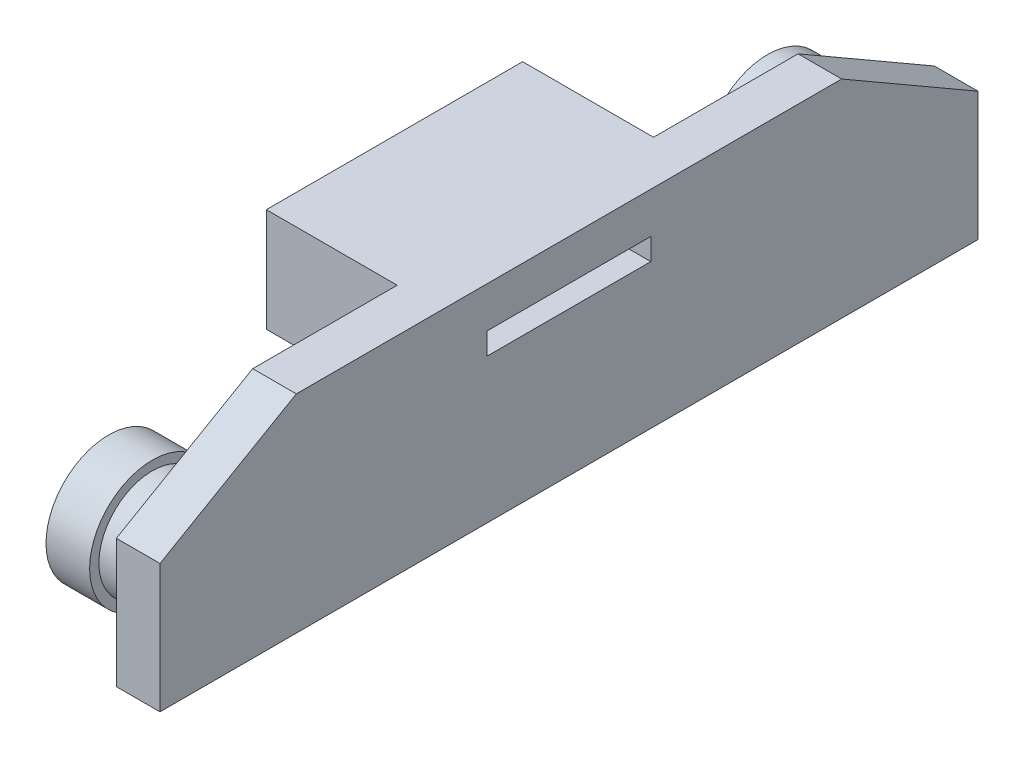
ISO-10303-21;
HEADER;
FILE_DESCRIPTION(('STEP AP214'),'2;1');
FILE_NAME('part.step','',(''),(''),'','','');
FILE_SCHEMA(('AUTOMOTIVE_DESIGN { 1 0 10303 214 1 1 1 1 }'));
ENDSEC;
DATA;
#1=APPLICATION_CONTEXT('core data for automotive mechanical design processes');
#2=APPLICATION_PROTOCOL_DEFINITION('international standard','automotive_design',2000,#1);
#3=PRODUCT_CONTEXT('',#1,'mechanical');
#4=PRODUCT('Part','Part','',(#3));
#5=PRODUCT_RELATED_PRODUCT_CATEGORY('part','',(#4));
#6=PRODUCT_DEFINITION_FORMATION('','',#4);
#7=PRODUCT_DEFINITION_CONTEXT('part definition',#1,'design');
#8=PRODUCT_DEFINITION('design','',#6,#7);
#9=PRODUCT_DEFINITION_SHAPE('','',#8);
#10=(LENGTH_UNIT() NAMED_UNIT(*) SI_UNIT(.MILLI.,.METRE.));
#11=(NAMED_UNIT(*) PLANE_ANGLE_UNIT() SI_UNIT($,.RADIAN.));
#12=(NAMED_UNIT(*) SI_UNIT($,.STERADIAN.) SOLID_ANGLE_UNIT());
#13=UNCERTAINTY_MEASURE_WITH_UNIT(LENGTH_MEASURE(1.E-05),#10,'distance_accuracy_value','');
#14=(GEOMETRIC_REPRESENTATION_CONTEXT(3) GLOBAL_UNCERTAINTY_ASSIGNED_CONTEXT((#13)) GLOBAL_UNIT_ASSIGNED_CONTEXT((#10,
#11,#12)) REPRESENTATION_CONTEXT('',''));
#15=CARTESIAN_POINT('',(0.,0.,0.));
#16=DIRECTION('',(0.,0.,1.));
#17=DIRECTION('',(1.,0.,0.));
#18=AXIS2_PLACEMENT_3D('',#15,#16,#17);
#19=CARTESIAN_POINT('',(-2.032,-1.94510300719157,-7.6708));
#20=DIRECTION('',(-1.,0.,0.));
#21=DIRECTION('',(0.,0.,1.));
#22=AXIS2_PLACEMENT_3D('',#19,#20,#21);
#23=PLANE('',#22);
#24=CARTESIAN_POINT('',(-2.032,-1.94510300719157,-7.6708));
#25=DIRECTION('',(-1.,0.,0.));
#26=DIRECTION('',(0.,0.,1.));
#27=AXIS2_PLACEMENT_3D('',#24,#25,#26);
#28=CIRCLE('',#27,1.4605);
#29=CARTESIAN_POINT('',(-2.032,-1.94510300719157,-6.2103));
#30=VERTEX_POINT('',#29);
#31=EDGE_CURVE('E20',#30,#30,#28,.F.);
#32=ORIENTED_EDGE('',*,*,#31,.F.);
#33=EDGE_LOOP('',(#32));
#34=FACE_BOUND('',#33,.T.);
#35=ADVANCED_FACE('F17',(#34),#23,.T.);
#36=CARTESIAN_POINT('',(-2.032,-1.94510300719157,7.6708));
#37=DIRECTION('',(-1.,0.,0.));
#38=DIRECTION('',(0.,0.,1.));
#39=AXIS2_PLACEMENT_3D('',#36,#37,#38);
#40=PLANE('',#39);
#41=CARTESIAN_POINT('',(-2.032,-1.94510300719157,7.6708));
#42=DIRECTION('',(-1.,0.,0.));
#43=DIRECTION('',(0.,0.,1.));
#44=AXIS2_PLACEMENT_3D('',#41,#42,#43);
#45=CIRCLE('',#44,1.4605);
#46=CARTESIAN_POINT('',(-2.032,-1.94510300719157,9.1313));
#47=VERTEX_POINT('',#46);
#48=EDGE_CURVE('E162',#47,#47,#45,.F.);
#49=ORIENTED_EDGE('',*,*,#48,.F.);
#50=EDGE_LOOP('',(#49));
#51=FACE_BOUND('',#50,.T.);
#52=ADVANCED_FACE('F173',(#51),#40,.T.);
#53=CARTESIAN_POINT('',(-1.016,-1.94510300719157,-7.6708));
#54=DIRECTION('',(-1.,0.,0.));
#55=DIRECTION('',(0.,0.,1.));
#56=AXIS2_PLACEMENT_3D('',#53,#54,#55);
#57=CYLINDRICAL_SURFACE('',#56,1.4605);
#58=ORIENTED_EDGE('',*,*,#31,.T.);
#59=EDGE_LOOP('',(#58));
#60=FACE_BOUND('',#59,.T.);
#61=CARTESIAN_POINT('',(-1.016,-1.94510300719157,-7.6708));
#62=DIRECTION('',(-1.,0.,0.));
#63=DIRECTION('',(0.,0.,1.));
#64=AXIS2_PLACEMENT_3D('',#61,#62,#63);
#65=CIRCLE('',#64,1.4605);
#66=CARTESIAN_POINT('',(-1.016,-1.94510300719157,-6.2103));
#67=VERTEX_POINT('',#66);
#68=EDGE_CURVE('E160',#67,#67,#65,.T.);
#69=ORIENTED_EDGE('',*,*,#68,.T.);
#70=EDGE_LOOP('',(#69));
#71=FACE_BOUND('',#70,.T.);
#72=ADVANCED_FACE('F169',(#60,#71),#57,.T.);
#73=CARTESIAN_POINT('',(-1.016,-1.94510300719157,7.6708));
#74=DIRECTION('',(-1.,0.,0.));
#75=DIRECTION('',(0.,0.,1.));
#76=AXIS2_PLACEMENT_3D('',#73,#74,#75);
#77=CYLINDRICAL_SURFACE('',#76,1.4605);
#78=ORIENTED_EDGE('',*,*,#48,.T.);
#79=EDGE_LOOP('',(#78));
#80=FACE_BOUND('',#79,.T.);
#81=CARTESIAN_POINT('',(-1.016,-1.94510300719157,7.6708));
#82=DIRECTION('',(-1.,0.,0.));
#83=DIRECTION('',(0.,0.,1.));
#84=AXIS2_PLACEMENT_3D('',#81,#82,#83);
#85=CIRCLE('',#84,1.4605);
#86=CARTESIAN_POINT('',(-1.016,-1.94510300719157,9.1313));
#87=VERTEX_POINT('',#86);
#88=EDGE_CURVE('E157',#87,#87,#85,.T.);
#89=ORIENTED_EDGE('',*,*,#88,.T.);
#90=EDGE_LOOP('',(#89));
#91=FACE_BOUND('',#90,.T.);
#92=ADVANCED_FACE('F257',(#80,#91),#77,.T.);
#93=CARTESIAN_POINT('',(-1.016,-1.94510300719157,-7.6708));
#94=DIRECTION('',(-1.,0.,0.));
#95=DIRECTION('',(0.,0.,1.));
#96=AXIS2_PLACEMENT_3D('',#93,#94,#95);
#97=PLANE('',#96);
#98=CARTESIAN_POINT('',(-1.016,-1.94510300719157,-7.6708));
#99=DIRECTION('',(1.,0.,0.));
#100=DIRECTION('',(0.,0.,-1.));
#101=AXIS2_PLACEMENT_3D('',#98,#99,#100);
#102=CIRCLE('',#101,1.2446);
#103=CARTESIAN_POINT('',(-1.016,-1.94510300719157,-8.9154));
#104=VERTEX_POINT('',#103);
#105=EDGE_CURVE('E154',#104,#104,#102,.T.);
#106=ORIENTED_EDGE('',*,*,#105,.F.);
#107=EDGE_LOOP('',(#106));
#108=FACE_BOUND('',#107,.T.);
#109=ORIENTED_EDGE('',*,*,#68,.F.);
#110=EDGE_LOOP('',(#109));
#111=FACE_BOUND('',#110,.T.);
#112=ADVANCED_FACE('F253',(#108,#111),#97,.F.);
#113=CARTESIAN_POINT('',(-1.016,-1.94510300719157,7.6708));
#114=DIRECTION('',(-1.,0.,0.));
#115=DIRECTION('',(0.,0.,1.));
#116=AXIS2_PLACEMENT_3D('',#113,#114,#115);
#117=PLANE('',#116);
#118=CARTESIAN_POINT('',(-1.016,-1.94510300719157,7.6708));
#119=DIRECTION('',(1.,0.,0.));
#120=DIRECTION('',(0.,0.,-1.));
#121=AXIS2_PLACEMENT_3D('',#118,#119,#120);
#122=CIRCLE('',#121,1.2446);
#123=CARTESIAN_POINT('',(-1.016,-1.94510300719157,6.42619999999999));
#124=VERTEX_POINT('',#123);
#125=EDGE_CURVE('E125',#124,#124,#122,.T.);
#126=ORIENTED_EDGE('',*,*,#125,.F.);
#127=EDGE_LOOP('',(#126));
#128=FACE_BOUND('',#127,.T.);
#129=ORIENTED_EDGE('',*,*,#88,.F.);
#130=EDGE_LOOP('',(#129));
#131=FACE_BOUND('',#130,.T.);
#132=ADVANCED_FACE('F249',(#128,#131),#117,.F.);
#133=CARTESIAN_POINT('',(-3.048,-1.94510300719157,-7.6708));
#134=DIRECTION('',(1.,0.,0.));
#135=DIRECTION('',(0.,0.,-1.));
#136=AXIS2_PLACEMENT_3D('',#133,#134,#135);
#137=CYLINDRICAL_SURFACE('',#136,1.2446);
#138=ORIENTED_EDGE('',*,*,#105,.T.);
#139=EDGE_LOOP('',(#138));
#140=FACE_BOUND('',#139,.T.);
#141=CARTESIAN_POINT('',(0.,-1.94510300719157,-7.6708));
#142=DIRECTION('',(1.,0.,0.));
#143=DIRECTION('',(0.,0.,-1.));
#144=AXIS2_PLACEMENT_3D('',#141,#142,#143);
#145=CIRCLE('',#144,1.2446);
#146=CARTESIAN_POINT('',(0.,-1.94510300719157,-8.9154));
#147=VERTEX_POINT('',#146);
#148=EDGE_CURVE('E141',#147,#147,#145,.F.);
#149=ORIENTED_EDGE('',*,*,#148,.T.);
#150=EDGE_LOOP('',(#149));
#151=FACE_BOUND('',#150,.T.);
#152=ADVANCED_FACE('F245',(#140,#151),#137,.T.);
#153=CARTESIAN_POINT('',(-3.048,-1.94510300719157,7.6708));
#154=DIRECTION('',(1.,0.,0.));
#155=DIRECTION('',(0.,0.,-1.));
#156=AXIS2_PLACEMENT_3D('',#153,#154,#155);
#157=CYLINDRICAL_SURFACE('',#156,1.2446);
#158=ORIENTED_EDGE('',*,*,#125,.T.);
#159=EDGE_LOOP('',(#158));
#160=FACE_BOUND('',#159,.T.);
#161=CARTESIAN_POINT('',(0.,-1.94510300719157,7.6708));
#162=DIRECTION('',(1.,0.,0.));
#163=DIRECTION('',(0.,0.,-1.));
#164=AXIS2_PLACEMENT_3D('',#161,#162,#163);
#165=CIRCLE('',#164,1.2446);
#166=CARTESIAN_POINT('',(0.,-1.94510300719157,6.42619999999999));
#167=VERTEX_POINT('',#166);
#168=EDGE_CURVE('E146',#167,#167,#165,.F.);
#169=ORIENTED_EDGE('',*,*,#168,.T.);
#170=EDGE_LOOP('',(#169));
#171=FACE_BOUND('',#170,.T.);
#172=ADVANCED_FACE('F242',(#160,#171),#157,.T.);
#173=CARTESIAN_POINT('',(-3.048,-1.2065,2.9845));
#174=DIRECTION('',(0.,-1.,0.));
#175=DIRECTION('',(0.,0.,-1.));
#176=AXIS2_PLACEMENT_3D('',#173,#174,#175);
#177=PLANE('',#176);
#178=DIRECTION('',(0.,0.,-1.));
#179=VECTOR('',#178,1.);
#180=CARTESIAN_POINT('',(0.,-1.2065,9.52499999999999));
#181=LINE('',#180,#179);
#182=CARTESIAN_POINT('',(0.,-1.2065,-2.9845));
#183=VERTEX_POINT('',#182);
#184=CARTESIAN_POINT('',(0.,-1.2065,2.9845));
#185=VERTEX_POINT('',#184);
#186=EDGE_CURVE('E114',#183,#185,#181,.F.);
#187=ORIENTED_EDGE('',*,*,#186,.T.);
#188=DIRECTION('',(1.,0.,0.));
#189=VECTOR('',#188,1.);
#190=CARTESIAN_POINT('',(-3.048,-1.2065,2.9845));
#191=LINE('',#190,#189);
#192=CARTESIAN_POINT('',(-3.048,-1.2065,2.9845));
#193=VERTEX_POINT('',#192);
#194=EDGE_CURVE('E124',#193,#185,#191,.T.);
#195=ORIENTED_EDGE('',*,*,#194,.F.);
#196=DIRECTION('',(0.,0.,-1.));
#197=VECTOR('',#196,1.);
#198=CARTESIAN_POINT('',(-3.048,-1.2065,-2.9845));
#199=LINE('',#198,#197);
#200=CARTESIAN_POINT('',(-3.048,-1.2065,-2.9845));
#201=VERTEX_POINT('',#200);
#202=EDGE_CURVE('E121',#193,#201,#199,.T.);
#203=ORIENTED_EDGE('',*,*,#202,.T.);
#204=DIRECTION('',(-1.,0.,0.));
#205=VECTOR('',#204,1.);
#206=CARTESIAN_POINT('',(-3.048,-1.2065,-2.9845));
#207=LINE('',#206,#205);
#208=EDGE_CURVE('E117',#183,#201,#207,.T.);
#209=ORIENTED_EDGE('',*,*,#208,.F.);
#210=EDGE_LOOP('',(#187,#195,#203,#209));
#211=FACE_BOUND('',#210,.T.);
#212=ADVANCED_FACE('F119',(#211),#177,.T.);
#213=CARTESIAN_POINT('',(-3.048,1.2065,-2.9845));
#214=DIRECTION('',(0.,0.,-1.));
#215=DIRECTION('',(-1.,0.,0.));
#216=AXIS2_PLACEMENT_3D('',#213,#214,#215);
#217=PLANE('',#216);
#218=DIRECTION('',(0.,1.,0.));
#219=VECTOR('',#218,1.);
#220=CARTESIAN_POINT('',(0.,1.2065,-2.9845));
#221=LINE('',#220,#219);
#222=CARTESIAN_POINT('',(0.,1.2065,-2.9845));
#223=VERTEX_POINT('',#222);
#224=EDGE_CURVE('E128',#223,#183,#221,.F.);
#225=ORIENTED_EDGE('',*,*,#224,.T.);
#226=ORIENTED_EDGE('',*,*,#208,.T.);
#227=DIRECTION('',(0.,1.,0.));
#228=VECTOR('',#227,1.);
#229=CARTESIAN_POINT('',(-3.048,-1.2065,-2.9845));
#230=LINE('',#229,#228);
#231=CARTESIAN_POINT('',(-3.048,1.2065,-2.9845));
#232=VERTEX_POINT('',#231);
#233=EDGE_CURVE('E149',#201,#232,#230,.T.);
#234=ORIENTED_EDGE('',*,*,#233,.T.);
#235=DIRECTION('',(1.,0.,0.));
#236=VECTOR('',#235,1.);
#237=CARTESIAN_POINT('',(-3.048,1.2065,-2.9845));
#238=LINE('',#237,#236);
#239=EDGE_CURVE('E131',#223,#232,#238,.F.);
#240=ORIENTED_EDGE('',*,*,#239,.F.);
#241=EDGE_LOOP('',(#225,#226,#234,#240));
#242=FACE_BOUND('',#241,.T.);
#243=ADVANCED_FACE('F129',(#242),#217,.T.);
#244=CARTESIAN_POINT('',(-3.048,1.2065,2.9845));
#245=DIRECTION('',(0.,0.,1.));
#246=DIRECTION('',(1.,0.,0.));
#247=AXIS2_PLACEMENT_3D('',#244,#245,#246);
#248=PLANE('',#247);
#249=DIRECTION('',(0.,1.,0.));
#250=VECTOR('',#249,1.);
#251=CARTESIAN_POINT('',(0.,1.2065,2.9845));
#252=LINE('',#251,#250);
#253=CARTESIAN_POINT('',(0.,1.2065,2.9845));
#254=VERTEX_POINT('',#253);
#255=EDGE_CURVE('E139',#185,#254,#252,.T.);
#256=ORIENTED_EDGE('',*,*,#255,.T.);
#257=DIRECTION('',(1.,0.,0.));
#258=VECTOR('',#257,1.);
#259=CARTESIAN_POINT('',(-3.048,1.2065,2.9845));
#260=LINE('',#259,#258);
#261=CARTESIAN_POINT('',(-3.048,1.2065,2.9845));
#262=VERTEX_POINT('',#261);
#263=EDGE_CURVE('E506',#262,#254,#260,.T.);
#264=ORIENTED_EDGE('',*,*,#263,.F.);
#265=DIRECTION('',(0.,1.,0.));
#266=VECTOR('',#265,1.);
#267=CARTESIAN_POINT('',(-3.048,-1.2065,2.9845));
#268=LINE('',#267,#266);
#269=EDGE_CURVE('E551',#262,#193,#268,.F.);
#270=ORIENTED_EDGE('',*,*,#269,.T.);
#271=ORIENTED_EDGE('',*,*,#194,.T.);
#272=EDGE_LOOP('',(#256,#264,#270,#271));
#273=FACE_BOUND('',#272,.T.);
#274=ADVANCED_FACE('F233',(#273),#248,.T.);
#275=CARTESIAN_POINT('',(0.,1.2065,9.52499999999999));
#276=DIRECTION('',(1.,0.,0.));
#277=DIRECTION('',(0.,0.,-1.));
#278=AXIS2_PLACEMENT_3D('',#275,#276,#277);
#279=PLANE('',#278);
#280=ORIENTED_EDGE('',*,*,#168,.F.);
#281=EDGE_LOOP('',(#280));
#282=FACE_BOUND('',#281,.T.);
#283=ORIENTED_EDGE('',*,*,#148,.F.);
#284=EDGE_LOOP('',(#283));
#285=FACE_BOUND('',#284,.T.);
#286=DIRECTION('',(0.,1.,0.));
#287=VECTOR('',#286,1.);
#288=CARTESIAN_POINT('',(0.,-3.6195,-9.525));
#289=LINE('',#288,#287);
#290=CARTESIAN_POINT('',(0.,-0.626587104677062,-9.525));
#291=VERTEX_POINT('',#290);
#292=CARTESIAN_POINT('',(0.,-3.6195,-9.525));
#293=VERTEX_POINT('',#292);
#294=EDGE_CURVE('E535',#291,#293,#289,.F.);
#295=ORIENTED_EDGE('',*,*,#294,.T.);
#296=DIRECTION('',(0.,0.,1.));
#297=VECTOR('',#296,1.);
#298=CARTESIAN_POINT('',(0.,-3.6195,-9.525));
#299=LINE('',#298,#297);
#300=CARTESIAN_POINT('',(0.,-3.6195,9.525));
#301=VERTEX_POINT('',#300);
#302=EDGE_CURVE('E539',#293,#301,#299,.T.);
#303=ORIENTED_EDGE('',*,*,#302,.T.);
#304=DIRECTION('',(0.,1.,0.));
#305=VECTOR('',#304,1.);
#306=CARTESIAN_POINT('',(0.,-3.6195,9.525));
#307=LINE('',#306,#305);
#308=CARTESIAN_POINT('',(0.,-0.626587104677062,9.525));
#309=VERTEX_POINT('',#308);
#310=EDGE_CURVE('E541',#301,#309,#307,.T.);
#311=ORIENTED_EDGE('',*,*,#310,.T.);
#312=DIRECTION('',(0.,-0.499999999999998,0.86602540378444));
#313=VECTOR('',#312,1.);
#314=CARTESIAN_POINT('',(0.,-0.626587104677061,9.525));
#315=LINE('',#314,#313);
#316=CARTESIAN_POINT('',(0.,1.2065,6.34999999999997));
#317=VERTEX_POINT('',#316);
#318=EDGE_CURVE('E511',#317,#309,#315,.T.);
#319=ORIENTED_EDGE('',*,*,#318,.F.);
#320=DIRECTION('',(0.,0.,1.));
#321=VECTOR('',#320,1.);
#322=CARTESIAN_POINT('',(0.,1.2065,2.9845));
#323=LINE('',#322,#321);
#324=EDGE_CURVE('E509',#254,#317,#323,.T.);
#325=ORIENTED_EDGE('',*,*,#324,.F.);
#326=ORIENTED_EDGE('',*,*,#255,.F.);
#327=ORIENTED_EDGE('',*,*,#186,.F.);
#328=ORIENTED_EDGE('',*,*,#224,.F.);
#329=DIRECTION('',(0.,0.,1.));
#330=VECTOR('',#329,1.);
#331=CARTESIAN_POINT('',(0.,1.2065,2.9845));
#332=LINE('',#331,#330);
#333=CARTESIAN_POINT('',(0.,1.2065,-6.34999999999999));
#334=VERTEX_POINT('',#333);
#335=EDGE_CURVE('E525',#334,#223,#332,.T.);
#336=ORIENTED_EDGE('',*,*,#335,.F.);
#337=DIRECTION('',(0.,0.499999999999998,0.86602540378444));
#338=VECTOR('',#337,1.);
#339=CARTESIAN_POINT('',(0.,1.2065,-6.34999999999998));
#340=LINE('',#339,#338);
#341=EDGE_CURVE('E531',#291,#334,#340,.T.);
#342=ORIENTED_EDGE('',*,*,#341,.F.);
#343=EDGE_LOOP('',(#295,#303,#311,#319,#325,#326,#327,#328,#336,#342));
#344=FACE_BOUND('',#343,.T.);
#345=ADVANCED_FACE('F137',(#282,#285,#344),#279,.F.);
#346=CARTESIAN_POINT('',(-3.048,-1.2065,-2.9845));
#347=DIRECTION('',(1.,0.,0.));
#348=DIRECTION('',(0.,0.,-1.));
#349=AXIS2_PLACEMENT_3D('',#346,#347,#348);
#350=PLANE('',#349);
#351=DIRECTION('',(0.,0.,-1.));
#352=VECTOR('',#351,1.);
#353=CARTESIAN_POINT('',(-3.048,-0.254,-1.905));
#354=LINE('',#353,#352);
#355=CARTESIAN_POINT('',(-3.048,-0.254,1.905));
#356=VERTEX_POINT('',#355);
#357=CARTESIAN_POINT('',(-3.048,-0.254,-1.905));
#358=VERTEX_POINT('',#357);
#359=EDGE_CURVE('E589',#356,#358,#354,.T.);
#360=ORIENTED_EDGE('',*,*,#359,.T.);
#361=DIRECTION('',(0.,1.,0.));
#362=VECTOR('',#361,1.);
#363=CARTESIAN_POINT('',(-3.048,-0.254,-1.905));
#364=LINE('',#363,#362);
#365=CARTESIAN_POINT('',(-3.048,0.254,-1.905));
#366=VERTEX_POINT('',#365);
#367=EDGE_CURVE('E545',#358,#366,#364,.T.);
#368=ORIENTED_EDGE('',*,*,#367,.T.);
#369=DIRECTION('',(0.,0.,1.));
#370=VECTOR('',#369,1.);
#371=CARTESIAN_POINT('',(-3.048,0.254,-1.905));
#372=LINE('',#371,#370);
#373=CARTESIAN_POINT('',(-3.048,0.254,1.905));
#374=VERTEX_POINT('',#373);
#375=EDGE_CURVE('E581',#366,#374,#372,.T.);
#376=ORIENTED_EDGE('',*,*,#375,.T.);
#377=DIRECTION('',(0.,1.,0.));
#378=VECTOR('',#377,1.);
#379=CARTESIAN_POINT('',(-3.048,-0.254,1.905));
#380=LINE('',#379,#378);
#381=EDGE_CURVE('E548',#374,#356,#380,.F.);
#382=ORIENTED_EDGE('',*,*,#381,.T.);
#383=EDGE_LOOP('',(#360,#368,#376,#382));
#384=FACE_BOUND('',#383,.T.);
#385=ORIENTED_EDGE('',*,*,#269,.F.);
#386=DIRECTION('',(0.,0.,1.));
#387=VECTOR('',#386,1.);
#388=CARTESIAN_POINT('',(-3.048,1.2065,2.9845));
#389=LINE('',#388,#387);
#390=EDGE_CURVE('E517',#232,#262,#389,.T.);
#391=ORIENTED_EDGE('',*,*,#390,.F.);
#392=ORIENTED_EDGE('',*,*,#233,.F.);
#393=ORIENTED_EDGE('',*,*,#202,.F.);
#394=EDGE_LOOP('',(#385,#391,#392,#393));
#395=FACE_BOUND('',#394,.T.);
#396=ADVANCED_FACE('F226',(#384,#395),#350,.F.);
#397=CARTESIAN_POINT('',(1.016,-0.254,1.905));
#398=DIRECTION('',(0.,0.,1.));
#399=DIRECTION('',(1.,0.,0.));
#400=AXIS2_PLACEMENT_3D('',#397,#398,#399);
#401=PLANE('',#400);
#402=DIRECTION('',(0.,1.,0.));
#403=VECTOR('',#402,1.);
#404=CARTESIAN_POINT('',(1.016,-0.254,1.905));
#405=LINE('',#404,#403);
#406=CARTESIAN_POINT('',(1.016,-0.254,1.905));
#407=VERTEX_POINT('',#406);
#408=CARTESIAN_POINT('',(1.016,0.254,1.905));
#409=VERTEX_POINT('',#408);
#410=EDGE_CURVE('E34',#407,#409,#405,.T.);
#411=ORIENTED_EDGE('',*,*,#410,.F.);
#412=DIRECTION('',(1.,0.,0.));
#413=VECTOR('',#412,1.);
#414=CARTESIAN_POINT('',(1.016,-0.254,1.905));
#415=LINE('',#414,#413);
#416=EDGE_CURVE('E583',#407,#356,#415,.F.);
#417=ORIENTED_EDGE('',*,*,#416,.T.);
#418=ORIENTED_EDGE('',*,*,#381,.F.);
#419=DIRECTION('',(1.,0.,0.));
#420=VECTOR('',#419,1.);
#421=CARTESIAN_POINT('',(1.016,0.254,1.905));
#422=LINE('',#421,#420);
#423=EDGE_CURVE('E579',#374,#409,#422,.T.);
#424=ORIENTED_EDGE('',*,*,#423,.T.);
#425=EDGE_LOOP('',(#411,#417,#418,#424));
#426=FACE_BOUND('',#425,.T.);
#427=ADVANCED_FACE('F222',(#426),#401,.F.);
#428=CARTESIAN_POINT('',(1.016,-0.254,-1.905));
#429=DIRECTION('',(0.,0.,-1.));
#430=DIRECTION('',(-1.,0.,0.));
#431=AXIS2_PLACEMENT_3D('',#428,#429,#430);
#432=PLANE('',#431);
#433=DIRECTION('',(0.,1.,0.));
#434=VECTOR('',#433,1.);
#435=CARTESIAN_POINT('',(1.016,-0.254,-1.905));
#436=LINE('',#435,#434);
#437=CARTESIAN_POINT('',(1.016,0.254,-1.905));
#438=VERTEX_POINT('',#437);
#439=CARTESIAN_POINT('',(1.016,-0.254,-1.905));
#440=VERTEX_POINT('',#439);
#441=EDGE_CURVE('E543',#438,#440,#436,.F.);
#442=ORIENTED_EDGE('',*,*,#441,.F.);
#443=DIRECTION('',(1.,0.,0.));
#444=VECTOR('',#443,1.);
#445=CARTESIAN_POINT('',(1.016,0.254,-1.905));
#446=LINE('',#445,#444);
#447=EDGE_CURVE('E576',#438,#366,#446,.F.);
#448=ORIENTED_EDGE('',*,*,#447,.T.);
#449=ORIENTED_EDGE('',*,*,#367,.F.);
#450=DIRECTION('',(1.,0.,0.));
#451=VECTOR('',#450,1.);
#452=CARTESIAN_POINT('',(1.016,-0.254,-1.905));
#453=LINE('',#452,#451);
#454=EDGE_CURVE('E586',#358,#440,#453,.T.);
#455=ORIENTED_EDGE('',*,*,#454,.T.);
#456=EDGE_LOOP('',(#442,#448,#449,#455));
#457=FACE_BOUND('',#456,.T.);
#458=ADVANCED_FACE('F218',(#457),#432,.F.);
#459=CARTESIAN_POINT('',(1.016,-3.6195,9.525));
#460=DIRECTION('',(0.,0.,-1.));
#461=DIRECTION('',(0.,1.,0.));
#462=AXIS2_PLACEMENT_3D('',#459,#460,#461);
#463=PLANE('',#462);
#464=ORIENTED_EDGE('',*,*,#310,.F.);
#465=DIRECTION('',(1.,0.,0.));
#466=VECTOR('',#465,1.);
#467=CARTESIAN_POINT('',(1.016,-3.6195,9.525));
#468=LINE('',#467,#466);
#469=CARTESIAN_POINT('',(1.016,-3.6195,9.525));
#470=VERTEX_POINT('',#469);
#471=EDGE_CURVE('E537',#301,#470,#468,.T.);
#472=ORIENTED_EDGE('',*,*,#471,.T.);
#473=DIRECTION('',(0.,1.,0.));
#474=VECTOR('',#473,1.);
#475=CARTESIAN_POINT('',(1.016,1.2065,9.525));
#476=LINE('',#475,#474);
#477=CARTESIAN_POINT('',(1.016,-0.626587104677061,9.525));
#478=VERTEX_POINT('',#477);
#479=EDGE_CURVE('E571',#478,#470,#476,.F.);
#480=ORIENTED_EDGE('',*,*,#479,.F.);
#481=DIRECTION('',(1.,0.,0.));
#482=VECTOR('',#481,1.);
#483=CARTESIAN_POINT('',(1.016,-0.626587104677061,9.525));
#484=LINE('',#483,#482);
#485=EDGE_CURVE('E519',#309,#478,#484,.T.);
#486=ORIENTED_EDGE('',*,*,#485,.F.);
#487=EDGE_LOOP('',(#464,#472,#480,#486));
#488=FACE_BOUND('',#487,.T.);
#489=ADVANCED_FACE('F214',(#488),#463,.F.);
#490=CARTESIAN_POINT('',(1.016,-3.6195,-9.525));
#491=DIRECTION('',(0.,1.,0.));
#492=DIRECTION('',(0.,0.,1.));
#493=AXIS2_PLACEMENT_3D('',#490,#491,#492);
#494=PLANE('',#493);
#495=DIRECTION('',(0.,0.,-1.));
#496=VECTOR('',#495,1.);
#497=CARTESIAN_POINT('',(1.016,-3.6195,9.52499999999999));
#498=LINE('',#497,#496);
#499=CARTESIAN_POINT('',(1.016,-3.6195,-9.525));
#500=VERTEX_POINT('',#499);
#501=EDGE_CURVE('E569',#470,#500,#498,.T.);
#502=ORIENTED_EDGE('',*,*,#501,.F.);
#503=ORIENTED_EDGE('',*,*,#471,.F.);
#504=ORIENTED_EDGE('',*,*,#302,.F.);
#505=DIRECTION('',(1.,0.,0.));
#506=VECTOR('',#505,1.);
#507=CARTESIAN_POINT('',(1.016,-3.6195,-9.525));
#508=LINE('',#507,#506);
#509=EDGE_CURVE('E533',#293,#500,#508,.T.);
#510=ORIENTED_EDGE('',*,*,#509,.T.);
#511=EDGE_LOOP('',(#502,#503,#504,#510));
#512=FACE_BOUND('',#511,.T.);
#513=ADVANCED_FACE('F210',(#512),#494,.F.);
#514=CARTESIAN_POINT('',(1.016,-3.6195,-9.525));
#515=DIRECTION('',(0.,0.,1.));
#516=DIRECTION('',(1.,0.,0.));
#517=AXIS2_PLACEMENT_3D('',#514,#515,#516);
#518=PLANE('',#517);
#519=DIRECTION('',(0.,1.,0.));
#520=VECTOR('',#519,1.);
#521=CARTESIAN_POINT('',(1.016,1.2065,-9.525));
#522=LINE('',#521,#520);
#523=CARTESIAN_POINT('',(1.016,-0.626587104677061,-9.525));
#524=VERTEX_POINT('',#523);
#525=EDGE_CURVE('E564',#500,#524,#522,.T.);
#526=ORIENTED_EDGE('',*,*,#525,.F.);
#527=ORIENTED_EDGE('',*,*,#509,.F.);
#528=ORIENTED_EDGE('',*,*,#294,.F.);
#529=DIRECTION('',(1.,0.,0.));
#530=VECTOR('',#529,1.);
#531=CARTESIAN_POINT('',(-3.048,-0.62658710467706,-9.525));
#532=LINE('',#531,#530);
#533=EDGE_CURVE('E514',#524,#291,#532,.F.);
#534=ORIENTED_EDGE('',*,*,#533,.F.);
#535=EDGE_LOOP('',(#526,#527,#528,#534));
#536=FACE_BOUND('',#535,.T.);
#537=ADVANCED_FACE('F206',(#536),#518,.F.);
#538=CARTESIAN_POINT('',(-3.048,1.2065,-6.34999999999998));
#539=DIRECTION('',(0.,0.86602540378444,-0.499999999999998));
#540=DIRECTION('',(0.,0.499999999999998,0.86602540378444));
#541=AXIS2_PLACEMENT_3D('',#538,#539,#540);
#542=PLANE('',#541);
#543=DIRECTION('',(0.,0.499999999999998,0.86602540378444));
#544=VECTOR('',#543,1.);
#545=CARTESIAN_POINT('',(1.016,-0.626587104677061,-9.525));
#546=LINE('',#545,#544);
#547=CARTESIAN_POINT('',(1.016,1.2065,-6.34999999999998));
#548=VERTEX_POINT('',#547);
#549=EDGE_CURVE('E560',#524,#548,#546,.T.);
#550=ORIENTED_EDGE('',*,*,#549,.F.);
#551=ORIENTED_EDGE('',*,*,#533,.T.);
#552=ORIENTED_EDGE('',*,*,#341,.T.);
#553=DIRECTION('',(1.,0.,0.));
#554=VECTOR('',#553,1.);
#555=CARTESIAN_POINT('',(-3.048,1.2065,-6.34999999999998));
#556=LINE('',#555,#554);
#557=EDGE_CURVE('E513',#548,#334,#556,.F.);
#558=ORIENTED_EDGE('',*,*,#557,.F.);
#559=EDGE_LOOP('',(#550,#551,#552,#558));
#560=FACE_BOUND('',#559,.T.);
#561=ADVANCED_FACE('F202',(#560),#542,.T.);
#562=CARTESIAN_POINT('',(-3.048,1.2065,2.9845));
#563=DIRECTION('',(0.,1.,0.));
#564=DIRECTION('',(0.,0.,1.));
#565=AXIS2_PLACEMENT_3D('',#562,#563,#564);
#566=PLANE('',#565);
#567=ORIENTED_EDGE('',*,*,#390,.T.);
#568=ORIENTED_EDGE('',*,*,#263,.T.);
#569=ORIENTED_EDGE('',*,*,#324,.T.);
#570=DIRECTION('',(1.,0.,0.));
#571=VECTOR('',#570,1.);
#572=CARTESIAN_POINT('',(1.016,1.20650000000001,6.34999999999997));
#573=LINE('',#572,#571);
#574=CARTESIAN_POINT('',(1.016,1.2065,6.34999999999997));
#575=VERTEX_POINT('',#574);
#576=EDGE_CURVE('E591',#575,#317,#573,.F.);
#577=ORIENTED_EDGE('',*,*,#576,.F.);
#578=DIRECTION('',(0.,0.,-1.));
#579=VECTOR('',#578,1.);
#580=CARTESIAN_POINT('',(1.016,1.2065,9.52499999999999));
#581=LINE('',#580,#579);
#582=EDGE_CURVE('E563',#548,#575,#581,.F.);
#583=ORIENTED_EDGE('',*,*,#582,.F.);
#584=ORIENTED_EDGE('',*,*,#557,.T.);
#585=ORIENTED_EDGE('',*,*,#335,.T.);
#586=ORIENTED_EDGE('',*,*,#239,.T.);
#587=EDGE_LOOP('',(#567,#568,#569,#577,#583,#584,#585,#586));
#588=FACE_BOUND('',#587,.T.);
#589=ADVANCED_FACE('F198',(#588),#566,.T.);
#590=CARTESIAN_POINT('',(1.016,-0.626587104677061,9.525));
#591=DIRECTION('',(0.,0.86602540378444,0.499999999999998));
#592=DIRECTION('',(0.,-0.499999999999998,0.86602540378444));
#593=AXIS2_PLACEMENT_3D('',#590,#591,#592);
#594=PLANE('',#593);
#595=DIRECTION('',(0.,-0.499999999999997,0.86602540378444));
#596=VECTOR('',#595,1.);
#597=CARTESIAN_POINT('',(1.016,1.2065,6.34999999999997));
#598=LINE('',#597,#596);
#599=EDGE_CURVE('E596',#575,#478,#598,.T.);
#600=ORIENTED_EDGE('',*,*,#599,.F.);
#601=ORIENTED_EDGE('',*,*,#576,.T.);
#602=ORIENTED_EDGE('',*,*,#318,.T.);
#603=ORIENTED_EDGE('',*,*,#485,.T.);
#604=EDGE_LOOP('',(#600,#601,#602,#603));
#605=FACE_BOUND('',#604,.T.);
#606=ADVANCED_FACE('F194',(#605),#594,.T.);
#607=CARTESIAN_POINT('',(1.016,-0.254,-1.905));
#608=DIRECTION('',(0.,-1.,0.));
#609=DIRECTION('',(0.,0.,-1.));
#610=AXIS2_PLACEMENT_3D('',#607,#608,#609);
#611=PLANE('',#610);
#612=DIRECTION('',(0.,0.,-1.));
#613=VECTOR('',#612,1.);
#614=CARTESIAN_POINT('',(1.016,-0.254,9.52499999999999));
#615=LINE('',#614,#613);
#616=EDGE_CURVE('E26',#440,#407,#615,.F.);
#617=ORIENTED_EDGE('',*,*,#616,.F.);
#618=ORIENTED_EDGE('',*,*,#454,.F.);
#619=ORIENTED_EDGE('',*,*,#359,.F.);
#620=ORIENTED_EDGE('',*,*,#416,.F.);
#621=EDGE_LOOP('',(#617,#618,#619,#620));
#622=FACE_BOUND('',#621,.T.);
#623=ADVANCED_FACE('F187',(#622),#611,.F.);
#624=CARTESIAN_POINT('',(1.016,0.254,-1.905));
#625=DIRECTION('',(0.,1.,0.));
#626=DIRECTION('',(0.,0.,1.));
#627=AXIS2_PLACEMENT_3D('',#624,#625,#626);
#628=PLANE('',#627);
#629=DIRECTION('',(0.,0.,-1.));
#630=VECTOR('',#629,1.);
#631=CARTESIAN_POINT('',(1.016,0.254,9.52499999999999));
#632=LINE('',#631,#630);
#633=EDGE_CURVE('E11',#409,#438,#632,.T.);
#634=ORIENTED_EDGE('',*,*,#633,.F.);
#635=ORIENTED_EDGE('',*,*,#423,.F.);
#636=ORIENTED_EDGE('',*,*,#375,.F.);
#637=ORIENTED_EDGE('',*,*,#447,.F.);
#638=EDGE_LOOP('',(#634,#635,#636,#637));
#639=FACE_BOUND('',#638,.T.);
#640=ADVANCED_FACE('F181',(#639),#628,.F.);
#641=CARTESIAN_POINT('',(1.016,1.2065,9.52499999999999));
#642=DIRECTION('',(1.,0.,0.));
#643=DIRECTION('',(0.,0.,-1.));
#644=AXIS2_PLACEMENT_3D('',#641,#642,#643);
#645=PLANE('',#644);
#646=ORIENTED_EDGE('',*,*,#410,.T.);
#647=ORIENTED_EDGE('',*,*,#633,.T.);
#648=ORIENTED_EDGE('',*,*,#441,.T.);
#649=ORIENTED_EDGE('',*,*,#616,.T.);
#650=EDGE_LOOP('',(#646,#647,#648,#649));
#651=FACE_BOUND('',#650,.T.);
#652=ORIENTED_EDGE('',*,*,#582,.T.);
#653=ORIENTED_EDGE('',*,*,#599,.T.);
#654=ORIENTED_EDGE('',*,*,#479,.T.);
#655=ORIENTED_EDGE('',*,*,#501,.T.);
#656=ORIENTED_EDGE('',*,*,#525,.T.);
#657=ORIENTED_EDGE('',*,*,#549,.T.);
#658=EDGE_LOOP('',(#652,#653,#654,#655,#656,#657));
#659=FACE_BOUND('',#658,.T.);
#660=ADVANCED_FACE('F179',(#651,#659),#645,.T.);
#661=CLOSED_SHELL('',(#35,#52,#72,#92,#112,#132,#152,#172,#212,#243,#274,#345,#396,#427,#458,
#489,#513,#537,#561,#589,#606,#623,#640,#660));
#662=MANIFOLD_SOLID_BREP('B1',#661);
#663=ADVANCED_BREP_SHAPE_REPRESENTATION('',(#18,#662),#14);
#664=SHAPE_DEFINITION_REPRESENTATION(#9,#663);
ENDSEC;
END-ISO-10303-21;
